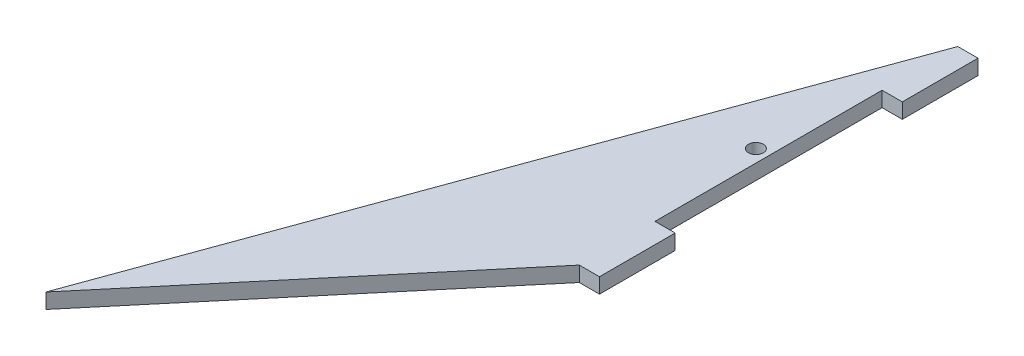
ISO-10303-21;
HEADER;
FILE_DESCRIPTION(('STEP AP214'),'2;1');
FILE_NAME('part.step','',(''),(''),'','','');
FILE_SCHEMA(('AUTOMOTIVE_DESIGN { 1 0 10303 214 1 1 1 1 }'));
ENDSEC;
DATA;
#1=APPLICATION_CONTEXT('core data for automotive mechanical design processes');
#2=APPLICATION_PROTOCOL_DEFINITION('international standard','automotive_design',2000,#1);
#3=PRODUCT_CONTEXT('',#1,'mechanical');
#4=PRODUCT('Part','Part','',(#3));
#5=PRODUCT_RELATED_PRODUCT_CATEGORY('part','',(#4));
#6=PRODUCT_DEFINITION_FORMATION('','',#4);
#7=PRODUCT_DEFINITION_CONTEXT('part definition',#1,'design');
#8=PRODUCT_DEFINITION('design','',#6,#7);
#9=PRODUCT_DEFINITION_SHAPE('','',#8);
#10=(LENGTH_UNIT() NAMED_UNIT(*) SI_UNIT(.MILLI.,.METRE.));
#11=(NAMED_UNIT(*) PLANE_ANGLE_UNIT() SI_UNIT($,.RADIAN.));
#12=(NAMED_UNIT(*) SI_UNIT($,.STERADIAN.) SOLID_ANGLE_UNIT());
#13=UNCERTAINTY_MEASURE_WITH_UNIT(LENGTH_MEASURE(1.E-05),#10,'distance_accuracy_value','');
#14=(GEOMETRIC_REPRESENTATION_CONTEXT(3) GLOBAL_UNCERTAINTY_ASSIGNED_CONTEXT((#13)) GLOBAL_UNIT_ASSIGNED_CONTEXT((#10,
#11,#12)) REPRESENTATION_CONTEXT('',''));
#15=CARTESIAN_POINT('',(0.,0.,0.));
#16=DIRECTION('',(0.,0.,1.));
#17=DIRECTION('',(1.,0.,0.));
#18=AXIS2_PLACEMENT_3D('',#15,#16,#17);
#19=CARTESIAN_POINT('',(0.,3.,-75.));
#20=DIRECTION('',(-1.,0.,0.));
#21=DIRECTION('',(0.,0.,1.));
#22=AXIS2_PLACEMENT_3D('',#19,#20,#21);
#23=PLANE('',#22);
#24=DIRECTION('',(0.,-1.,0.));
#25=VECTOR('',#24,1.);
#26=CARTESIAN_POINT('',(0.,0.,-60.));
#27=LINE('',#26,#25);
#28=CARTESIAN_POINT('',(0.,3.,-60.));
#29=VERTEX_POINT('',#28);
#30=CARTESIAN_POINT('',(0.,0.,-60.));
#31=VERTEX_POINT('',#30);
#32=EDGE_CURVE('E49',#29,#31,#27,.T.);
#33=ORIENTED_EDGE('',*,*,#32,.F.);
#34=DIRECTION('',(0.,0.,-1.));
#35=VECTOR('',#34,1.);
#36=CARTESIAN_POINT('',(0.,3.,-75.));
#37=LINE('',#36,#35);
#38=CARTESIAN_POINT('',(0.,3.,-15.));
#39=VERTEX_POINT('',#38);
#40=EDGE_CURVE('E158',#39,#29,#37,.T.);
#41=ORIENTED_EDGE('',*,*,#40,.F.);
#42=DIRECTION('',(0.,1.,0.));
#43=VECTOR('',#42,1.);
#44=CARTESIAN_POINT('',(0.,0.,-15.));
#45=LINE('',#44,#43);
#46=CARTESIAN_POINT('',(0.,0.,-15.));
#47=VERTEX_POINT('',#46);
#48=EDGE_CURVE('E126',#47,#39,#45,.T.);
#49=ORIENTED_EDGE('',*,*,#48,.F.);
#50=DIRECTION('',(0.,0.,-1.));
#51=VECTOR('',#50,1.);
#52=CARTESIAN_POINT('',(0.,0.,-75.));
#53=LINE('',#52,#51);
#54=EDGE_CURVE('E54',#47,#31,#53,.T.);
#55=ORIENTED_EDGE('',*,*,#54,.T.);
#56=EDGE_LOOP('',(#33,#41,#49,#55));
#57=FACE_BOUND('',#56,.T.);
#58=ADVANCED_FACE('F34',(#57),#23,.F.);
#59=CARTESIAN_POINT('',(0.,3.,0.));
#60=DIRECTION('',(-0.766044443118977,0.,-0.64278760968654));
#61=DIRECTION('',(-0.64278760968654,0.,0.766044443118977));
#62=AXIS2_PLACEMENT_3D('',#59,#60,#61);
#63=PLANE('',#62);
#64=DIRECTION('',(0.64278760968654,0.,-0.766044443118977));
#65=VECTOR('',#64,1.);
#66=CARTESIAN_POINT('',(0.,0.,0.));
#67=LINE('',#66,#65);
#68=CARTESIAN_POINT('',(-48.2090707264923,0.,57.4533332339254));
#69=VERTEX_POINT('',#68);
#70=CARTESIAN_POINT('',(0.,0.,0.));
#71=VERTEX_POINT('',#70);
#72=EDGE_CURVE('E155',#69,#71,#67,.T.);
#73=ORIENTED_EDGE('',*,*,#72,.T.);
#74=DIRECTION('',(0.,-1.,0.));
#75=VECTOR('',#74,1.);
#76=CARTESIAN_POINT('',(0.,3.,0.));
#77=LINE('',#76,#75);
#78=CARTESIAN_POINT('',(0.,3.,0.));
#79=VERTEX_POINT('',#78);
#80=EDGE_CURVE('E11',#79,#71,#77,.T.);
#81=ORIENTED_EDGE('',*,*,#80,.F.);
#82=DIRECTION('',(0.64278760968654,0.,-0.766044443118977));
#83=VECTOR('',#82,1.);
#84=CARTESIAN_POINT('',(0.,3.,0.));
#85=LINE('',#84,#83);
#86=CARTESIAN_POINT('',(-48.2090707264923,3.,57.4533332339254));
#87=VERTEX_POINT('',#86);
#88=EDGE_CURVE('E156',#87,#79,#85,.T.);
#89=ORIENTED_EDGE('',*,*,#88,.F.);
#90=DIRECTION('',(0.,-1.,0.));
#91=VECTOR('',#90,1.);
#92=CARTESIAN_POINT('',(-48.2090707264923,3.,57.4533332339254));
#93=LINE('',#92,#91);
#94=EDGE_CURVE('E163',#87,#69,#93,.T.);
#95=ORIENTED_EDGE('',*,*,#94,.T.);
#96=EDGE_LOOP('',(#73,#81,#89,#95));
#97=FACE_BOUND('',#96,.T.);
#98=ADVANCED_FACE('F36',(#97),#63,.F.);
#99=CARTESIAN_POINT('',(-48.2090707264923,3.,57.4533332339254));
#100=DIRECTION('',(0.939692620785906,0.,0.342020143325676));
#101=DIRECTION('',(0.342020143325676,0.,-0.939692620785906));
#102=AXIS2_PLACEMENT_3D('',#99,#100,#101);
#103=PLANE('',#102);
#104=DIRECTION('',(-0.342020143325676,0.,0.939692620785906));
#105=VECTOR('',#104,1.);
#106=CARTESIAN_POINT('',(-48.2090707264923,0.,57.4533332339254));
#107=LINE('',#106,#105);
#108=CARTESIAN_POINT('',(0.,0.,-75.));
#109=VERTEX_POINT('',#108);
#110=EDGE_CURVE('E159',#109,#69,#107,.T.);
#111=ORIENTED_EDGE('',*,*,#110,.T.);
#112=ORIENTED_EDGE('',*,*,#94,.F.);
#113=DIRECTION('',(-0.342020143325676,0.,0.939692620785906));
#114=VECTOR('',#113,1.);
#115=CARTESIAN_POINT('',(-48.2090707264923,3.,57.4533332339254));
#116=LINE('',#115,#114);
#117=CARTESIAN_POINT('',(0.,3.,-75.));
#118=VERTEX_POINT('',#117);
#119=EDGE_CURVE('E161',#118,#87,#116,.T.);
#120=ORIENTED_EDGE('',*,*,#119,.F.);
#121=DIRECTION('',(0.,-1.,0.));
#122=VECTOR('',#121,1.);
#123=CARTESIAN_POINT('',(0.,3.,-75.));
#124=LINE('',#123,#122);
#125=EDGE_CURVE('E42',#118,#109,#124,.T.);
#126=ORIENTED_EDGE('',*,*,#125,.T.);
#127=EDGE_LOOP('',(#111,#112,#120,#126));
#128=FACE_BOUND('',#127,.T.);
#129=ADVANCED_FACE('F169',(#128),#103,.F.);
#130=CARTESIAN_POINT('',(0.,3.,0.));
#131=DIRECTION('',(0.,1.,0.));
#132=DIRECTION('',(0.,0.,1.));
#133=AXIS2_PLACEMENT_3D('',#130,#131,#132);
#134=PLANE('',#133);
#135=CARTESIAN_POINT('',(-2.5,3.,-37.5));
#136=DIRECTION('',(0.,1.,0.));
#137=DIRECTION('',(0.,0.,1.));
#138=AXIS2_PLACEMENT_3D('',#135,#136,#137);
#139=CIRCLE('',#138,1.4732);
#140=CARTESIAN_POINT('',(-2.5,3.,-36.0268));
#141=VERTEX_POINT('',#140);
#142=EDGE_CURVE('E180',#141,#141,#139,.T.);
#143=ORIENTED_EDGE('',*,*,#142,.F.);
#144=EDGE_LOOP('',(#143));
#145=FACE_BOUND('',#144,.T.);
#146=ORIENTED_EDGE('',*,*,#88,.T.);
#147=DIRECTION('',(-1.,0.,0.));
#148=VECTOR('',#147,1.);
#149=CARTESIAN_POINT('',(4.,3.,0.));
#150=LINE('',#149,#148);
#151=CARTESIAN_POINT('',(4.,3.,0.));
#152=VERTEX_POINT('',#151);
#153=EDGE_CURVE('E142',#152,#79,#150,.T.);
#154=ORIENTED_EDGE('',*,*,#153,.F.);
#155=DIRECTION('',(0.,0.,1.));
#156=VECTOR('',#155,1.);
#157=CARTESIAN_POINT('',(4.,3.,0.));
#158=LINE('',#157,#156);
#159=CARTESIAN_POINT('',(4.,3.,-15.));
#160=VERTEX_POINT('',#159);
#161=EDGE_CURVE('E141',#160,#152,#158,.T.);
#162=ORIENTED_EDGE('',*,*,#161,.F.);
#163=DIRECTION('',(-1.,0.,0.));
#164=VECTOR('',#163,1.);
#165=CARTESIAN_POINT('',(4.,3.,-15.));
#166=LINE('',#165,#164);
#167=EDGE_CURVE('E146',#160,#39,#166,.T.);
#168=ORIENTED_EDGE('',*,*,#167,.T.);
#169=ORIENTED_EDGE('',*,*,#40,.T.);
#170=DIRECTION('',(-1.,0.,0.));
#171=VECTOR('',#170,1.);
#172=CARTESIAN_POINT('',(4.,3.,-60.));
#173=LINE('',#172,#171);
#174=CARTESIAN_POINT('',(4.,3.,-60.));
#175=VERTEX_POINT('',#174);
#176=EDGE_CURVE('E110',#175,#29,#173,.T.);
#177=ORIENTED_EDGE('',*,*,#176,.F.);
#178=DIRECTION('',(0.,0.,1.));
#179=VECTOR('',#178,1.);
#180=CARTESIAN_POINT('',(4.,3.,-75.));
#181=LINE('',#180,#179);
#182=CARTESIAN_POINT('',(4.,3.,-75.));
#183=VERTEX_POINT('',#182);
#184=EDGE_CURVE('E103',#183,#175,#181,.T.);
#185=ORIENTED_EDGE('',*,*,#184,.F.);
#186=DIRECTION('',(-1.,0.,0.));
#187=VECTOR('',#186,1.);
#188=CARTESIAN_POINT('',(4.,3.,-75.));
#189=LINE('',#188,#187);
#190=EDGE_CURVE('E107',#183,#118,#189,.T.);
#191=ORIENTED_EDGE('',*,*,#190,.T.);
#192=ORIENTED_EDGE('',*,*,#119,.T.);
#193=EDGE_LOOP('',(#146,#154,#162,#168,#169,#177,#185,#191,#192));
#194=FACE_BOUND('',#193,.T.);
#195=ADVANCED_FACE('F105',(#145,#194),#134,.T.);
#196=CARTESIAN_POINT('',(0.,0.,0.));
#197=DIRECTION('',(0.,1.,0.));
#198=DIRECTION('',(0.,0.,1.));
#199=AXIS2_PLACEMENT_3D('',#196,#197,#198);
#200=PLANE('',#199);
#201=CARTESIAN_POINT('',(-2.5,0.,-37.5));
#202=DIRECTION('',(0.,1.,0.));
#203=DIRECTION('',(0.,0.,1.));
#204=AXIS2_PLACEMENT_3D('',#201,#202,#203);
#205=CIRCLE('',#204,1.4732);
#206=CARTESIAN_POINT('',(-2.5,0.,-36.0268));
#207=VERTEX_POINT('',#206);
#208=EDGE_CURVE('E177',#207,#207,#205,.T.);
#209=ORIENTED_EDGE('',*,*,#208,.T.);
#210=EDGE_LOOP('',(#209));
#211=FACE_BOUND('',#210,.T.);
#212=ORIENTED_EDGE('',*,*,#72,.F.);
#213=ORIENTED_EDGE('',*,*,#110,.F.);
#214=DIRECTION('',(-1.,0.,0.));
#215=VECTOR('',#214,1.);
#216=CARTESIAN_POINT('',(4.,0.,-75.));
#217=LINE('',#216,#215);
#218=CARTESIAN_POINT('',(4.,0.,-75.));
#219=VERTEX_POINT('',#218);
#220=EDGE_CURVE('E171',#219,#109,#217,.T.);
#221=ORIENTED_EDGE('',*,*,#220,.F.);
#222=DIRECTION('',(0.,0.,-1.));
#223=VECTOR('',#222,1.);
#224=CARTESIAN_POINT('',(4.,0.,-75.));
#225=LINE('',#224,#223);
#226=CARTESIAN_POINT('',(4.,0.,-60.));
#227=VERTEX_POINT('',#226);
#228=EDGE_CURVE('E119',#227,#219,#225,.T.);
#229=ORIENTED_EDGE('',*,*,#228,.F.);
#230=DIRECTION('',(-1.,0.,0.));
#231=VECTOR('',#230,1.);
#232=CARTESIAN_POINT('',(4.,0.,-60.));
#233=LINE('',#232,#231);
#234=EDGE_CURVE('E131',#227,#31,#233,.T.);
#235=ORIENTED_EDGE('',*,*,#234,.T.);
#236=ORIENTED_EDGE('',*,*,#54,.F.);
#237=DIRECTION('',(-1.,0.,0.));
#238=VECTOR('',#237,1.);
#239=CARTESIAN_POINT('',(4.,0.,-15.));
#240=LINE('',#239,#238);
#241=CARTESIAN_POINT('',(4.,0.,-15.));
#242=VERTEX_POINT('',#241);
#243=EDGE_CURVE('E149',#242,#47,#240,.T.);
#244=ORIENTED_EDGE('',*,*,#243,.F.);
#245=DIRECTION('',(0.,0.,-1.));
#246=VECTOR('',#245,1.);
#247=CARTESIAN_POINT('',(4.,0.,0.));
#248=LINE('',#247,#246);
#249=CARTESIAN_POINT('',(4.,0.,0.));
#250=VERTEX_POINT('',#249);
#251=EDGE_CURVE('E137',#250,#242,#248,.T.);
#252=ORIENTED_EDGE('',*,*,#251,.F.);
#253=DIRECTION('',(-1.,0.,0.));
#254=VECTOR('',#253,1.);
#255=CARTESIAN_POINT('',(4.,0.,0.));
#256=LINE('',#255,#254);
#257=EDGE_CURVE('E152',#250,#71,#256,.T.);
#258=ORIENTED_EDGE('',*,*,#257,.T.);
#259=EDGE_LOOP('',(#212,#213,#221,#229,#235,#236,#244,#252,#258));
#260=FACE_BOUND('',#259,.T.);
#261=ADVANCED_FACE('F186',(#211,#260),#200,.F.);
#262=CARTESIAN_POINT('',(4.,0.,0.));
#263=DIRECTION('',(0.,0.,-1.));
#264=DIRECTION('',(-1.,0.,0.));
#265=AXIS2_PLACEMENT_3D('',#262,#263,#264);
#266=PLANE('',#265);
#267=ORIENTED_EDGE('',*,*,#80,.T.);
#268=ORIENTED_EDGE('',*,*,#257,.F.);
#269=DIRECTION('',(0.,-1.,0.));
#270=VECTOR('',#269,1.);
#271=CARTESIAN_POINT('',(4.,0.,0.));
#272=LINE('',#271,#270);
#273=EDGE_CURVE('E129',#152,#250,#272,.T.);
#274=ORIENTED_EDGE('',*,*,#273,.F.);
#275=ORIENTED_EDGE('',*,*,#153,.T.);
#276=EDGE_LOOP('',(#267,#268,#274,#275));
#277=FACE_BOUND('',#276,.T.);
#278=ADVANCED_FACE('F200',(#277),#266,.F.);
#279=CARTESIAN_POINT('',(4.,0.,-15.));
#280=DIRECTION('',(0.,0.,1.));
#281=DIRECTION('',(1.,0.,0.));
#282=AXIS2_PLACEMENT_3D('',#279,#280,#281);
#283=PLANE('',#282);
#284=ORIENTED_EDGE('',*,*,#48,.T.);
#285=ORIENTED_EDGE('',*,*,#167,.F.);
#286=DIRECTION('',(0.,1.,0.));
#287=VECTOR('',#286,1.);
#288=CARTESIAN_POINT('',(4.,0.,-15.));
#289=LINE('',#288,#287);
#290=EDGE_CURVE('E139',#242,#160,#289,.T.);
#291=ORIENTED_EDGE('',*,*,#290,.F.);
#292=ORIENTED_EDGE('',*,*,#243,.T.);
#293=EDGE_LOOP('',(#284,#285,#291,#292));
#294=FACE_BOUND('',#293,.T.);
#295=ADVANCED_FACE('F225',(#294),#283,.F.);
#296=CARTESIAN_POINT('',(4.,0.,0.));
#297=DIRECTION('',(-1.,0.,0.));
#298=DIRECTION('',(0.,0.,1.));
#299=AXIS2_PLACEMENT_3D('',#296,#297,#298);
#300=PLANE('',#299);
#301=ORIENTED_EDGE('',*,*,#273,.T.);
#302=ORIENTED_EDGE('',*,*,#251,.T.);
#303=ORIENTED_EDGE('',*,*,#290,.T.);
#304=ORIENTED_EDGE('',*,*,#161,.T.);
#305=EDGE_LOOP('',(#301,#302,#303,#304));
#306=FACE_BOUND('',#305,.T.);
#307=ADVANCED_FACE('F222',(#306),#300,.F.);
#308=CARTESIAN_POINT('',(4.,0.,-75.));
#309=DIRECTION('',(0.,0.,1.));
#310=DIRECTION('',(1.,0.,0.));
#311=AXIS2_PLACEMENT_3D('',#308,#309,#310);
#312=PLANE('',#311);
#313=ORIENTED_EDGE('',*,*,#125,.F.);
#314=ORIENTED_EDGE('',*,*,#190,.F.);
#315=DIRECTION('',(0.,1.,0.));
#316=VECTOR('',#315,1.);
#317=CARTESIAN_POINT('',(4.,0.,-75.));
#318=LINE('',#317,#316);
#319=EDGE_CURVE('E114',#219,#183,#318,.T.);
#320=ORIENTED_EDGE('',*,*,#319,.F.);
#321=ORIENTED_EDGE('',*,*,#220,.T.);
#322=EDGE_LOOP('',(#313,#314,#320,#321));
#323=FACE_BOUND('',#322,.T.);
#324=ADVANCED_FACE('F124',(#323),#312,.F.);
#325=CARTESIAN_POINT('',(4.,0.,-60.));
#326=DIRECTION('',(0.,0.,-1.));
#327=DIRECTION('',(-1.,0.,0.));
#328=AXIS2_PLACEMENT_3D('',#325,#326,#327);
#329=PLANE('',#328);
#330=ORIENTED_EDGE('',*,*,#32,.T.);
#331=ORIENTED_EDGE('',*,*,#234,.F.);
#332=DIRECTION('',(0.,-1.,0.));
#333=VECTOR('',#332,1.);
#334=CARTESIAN_POINT('',(4.,0.,-60.));
#335=LINE('',#334,#333);
#336=EDGE_CURVE('E113',#175,#227,#335,.T.);
#337=ORIENTED_EDGE('',*,*,#336,.F.);
#338=ORIENTED_EDGE('',*,*,#176,.T.);
#339=EDGE_LOOP('',(#330,#331,#337,#338));
#340=FACE_BOUND('',#339,.T.);
#341=ADVANCED_FACE('F228',(#340),#329,.F.);
#342=CARTESIAN_POINT('',(4.,0.,0.));
#343=DIRECTION('',(1.,0.,0.));
#344=DIRECTION('',(0.,0.,-1.));
#345=AXIS2_PLACEMENT_3D('',#342,#343,#344);
#346=PLANE('',#345);
#347=ORIENTED_EDGE('',*,*,#319,.T.);
#348=ORIENTED_EDGE('',*,*,#184,.T.);
#349=ORIENTED_EDGE('',*,*,#336,.T.);
#350=ORIENTED_EDGE('',*,*,#228,.T.);
#351=EDGE_LOOP('',(#347,#348,#349,#350));
#352=FACE_BOUND('',#351,.T.);
#353=ADVANCED_FACE('F117',(#352),#346,.T.);
#354=CARTESIAN_POINT('',(-2.5,0.,-37.5));
#355=DIRECTION('',(0.,1.,0.));
#356=DIRECTION('',(0.,0.,1.));
#357=AXIS2_PLACEMENT_3D('',#354,#355,#356);
#358=CYLINDRICAL_SURFACE('',#357,1.4732);
#359=ORIENTED_EDGE('',*,*,#208,.F.);
#360=EDGE_LOOP('',(#359));
#361=FACE_BOUND('',#360,.T.);
#362=ORIENTED_EDGE('',*,*,#142,.T.);
#363=EDGE_LOOP('',(#362));
#364=FACE_BOUND('',#363,.T.);
#365=ADVANCED_FACE('F188',(#361,#364),#358,.F.);
#366=CLOSED_SHELL('',(#58,#98,#129,#195,#261,#278,#295,#307,#324,#341,#353,#365));
#367=MANIFOLD_SOLID_BREP('B2',#366);
#368=ADVANCED_BREP_SHAPE_REPRESENTATION('',(#18,#367),#14);
#369=SHAPE_DEFINITION_REPRESENTATION(#9,#368);
ENDSEC;
END-ISO-10303-21;
